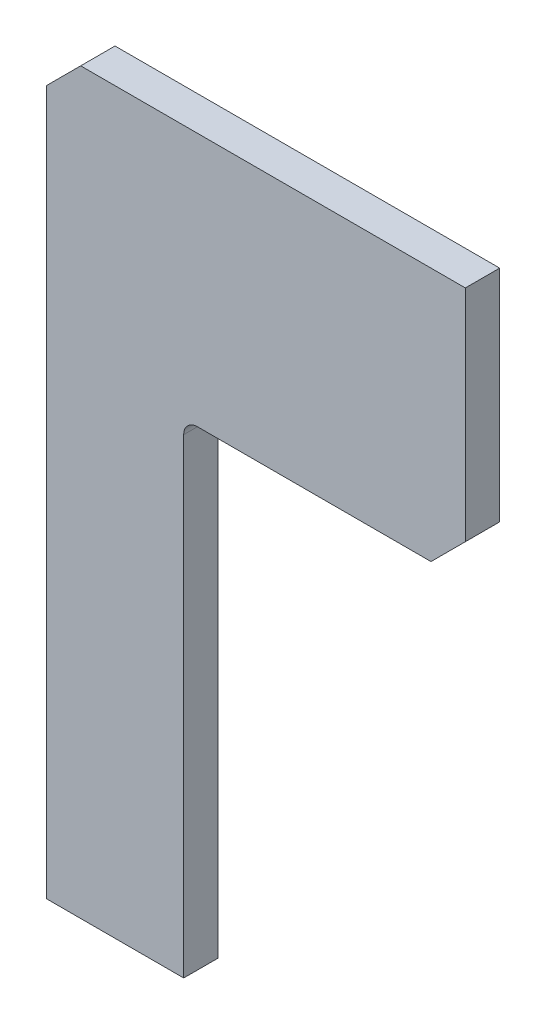
ISO-10303-21;
HEADER;
FILE_DESCRIPTION(('STEP AP214'),'2;1');
FILE_NAME('part.step','',(''),(''),'','','');
FILE_SCHEMA(('AUTOMOTIVE_DESIGN { 1 0 10303 214 1 1 1 1 }'));
ENDSEC;
DATA;
#1=APPLICATION_CONTEXT('core data for automotive mechanical design processes');
#2=APPLICATION_PROTOCOL_DEFINITION('international standard','automotive_design',2000,#1);
#3=PRODUCT_CONTEXT('',#1,'mechanical');
#4=PRODUCT('Part','Part','',(#3));
#5=PRODUCT_RELATED_PRODUCT_CATEGORY('part','',(#4));
#6=PRODUCT_DEFINITION_FORMATION('','',#4);
#7=PRODUCT_DEFINITION_CONTEXT('part definition',#1,'design');
#8=PRODUCT_DEFINITION('design','',#6,#7);
#9=PRODUCT_DEFINITION_SHAPE('','',#8);
#10=(LENGTH_UNIT() NAMED_UNIT(*) SI_UNIT(.MILLI.,.METRE.));
#11=(NAMED_UNIT(*) PLANE_ANGLE_UNIT() SI_UNIT($,.RADIAN.));
#12=(NAMED_UNIT(*) SI_UNIT($,.STERADIAN.) SOLID_ANGLE_UNIT());
#13=UNCERTAINTY_MEASURE_WITH_UNIT(LENGTH_MEASURE(1.E-05),#10,'distance_accuracy_value','');
#14=(GEOMETRIC_REPRESENTATION_CONTEXT(3) GLOBAL_UNCERTAINTY_ASSIGNED_CONTEXT((#13)) GLOBAL_UNIT_ASSIGNED_CONTEXT((#10,
#11,#12)) REPRESENTATION_CONTEXT('',''));
#15=CARTESIAN_POINT('',(0.,0.,0.));
#16=DIRECTION('',(0.,0.,1.));
#17=DIRECTION('',(1.,0.,0.));
#18=AXIS2_PLACEMENT_3D('',#15,#16,#17);
#19=CARTESIAN_POINT('',(40.,0.,10.));
#20=DIRECTION('',(0.,1.,0.));
#21=DIRECTION('',(-1.,0.,0.));
#22=AXIS2_PLACEMENT_3D('',#19,#20,#21);
#23=PLANE('',#22);
#24=DIRECTION('',(1.,0.,0.));
#25=VECTOR('',#24,1.);
#26=CARTESIAN_POINT('',(40.,0.,0.));
#27=LINE('',#26,#25);
#28=CARTESIAN_POINT('',(0.,0.,0.));
#29=VERTEX_POINT('',#28);
#30=CARTESIAN_POINT('',(40.,0.,0.));
#31=VERTEX_POINT('',#30);
#32=EDGE_CURVE('E135',#29,#31,#27,.T.);
#33=ORIENTED_EDGE('',*,*,#32,.T.);
#34=DIRECTION('',(0.,0.,-1.));
#35=VECTOR('',#34,1.);
#36=CARTESIAN_POINT('',(40.,0.,10.));
#37=LINE('',#36,#35);
#38=CARTESIAN_POINT('',(40.,0.,10.));
#39=VERTEX_POINT('',#38);
#40=EDGE_CURVE('E11',#39,#31,#37,.T.);
#41=ORIENTED_EDGE('',*,*,#40,.F.);
#42=DIRECTION('',(1.,0.,0.));
#43=VECTOR('',#42,1.);
#44=CARTESIAN_POINT('',(40.,0.,10.));
#45=LINE('',#44,#43);
#46=CARTESIAN_POINT('',(0.,0.,10.));
#47=VERTEX_POINT('',#46);
#48=EDGE_CURVE('E151',#47,#39,#45,.T.);
#49=ORIENTED_EDGE('',*,*,#48,.F.);
#50=DIRECTION('',(0.,0.,-1.));
#51=VECTOR('',#50,1.);
#52=CARTESIAN_POINT('',(0.,0.,10.));
#53=LINE('',#52,#51);
#54=EDGE_CURVE('E131',#47,#29,#53,.T.);
#55=ORIENTED_EDGE('',*,*,#54,.T.);
#56=EDGE_LOOP('',(#33,#41,#49,#55));
#57=FACE_BOUND('',#56,.T.);
#58=ADVANCED_FACE('F33',(#57),#23,.F.);
#59=CARTESIAN_POINT('',(40.,137.,10.));
#60=DIRECTION('',(-1.,0.,0.));
#61=DIRECTION('',(0.,-1.,0.));
#62=AXIS2_PLACEMENT_3D('',#59,#60,#61);
#63=PLANE('',#62);
#64=DIRECTION('',(0.,1.,0.));
#65=VECTOR('',#64,1.);
#66=CARTESIAN_POINT('',(40.,137.,0.));
#67=LINE('',#66,#65);
#68=CARTESIAN_POINT('',(40.,137.,0.));
#69=VERTEX_POINT('',#68);
#70=EDGE_CURVE('E138',#31,#69,#67,.T.);
#71=ORIENTED_EDGE('',*,*,#70,.T.);
#72=DIRECTION('',(0.,0.,-1.));
#73=VECTOR('',#72,1.);
#74=CARTESIAN_POINT('',(40.,137.,10.));
#75=LINE('',#74,#73);
#76=CARTESIAN_POINT('',(40.,137.,10.));
#77=VERTEX_POINT('',#76);
#78=EDGE_CURVE('E41',#77,#69,#75,.T.);
#79=ORIENTED_EDGE('',*,*,#78,.F.);
#80=DIRECTION('',(0.,1.,0.));
#81=VECTOR('',#80,1.);
#82=CARTESIAN_POINT('',(40.,137.,10.));
#83=LINE('',#82,#81);
#84=EDGE_CURVE('E95',#39,#77,#83,.T.);
#85=ORIENTED_EDGE('',*,*,#84,.F.);
#86=ORIENTED_EDGE('',*,*,#40,.T.);
#87=EDGE_LOOP('',(#71,#79,#85,#86));
#88=FACE_BOUND('',#87,.T.);
#89=ADVANCED_FACE('F194',(#88),#63,.F.);
#90=CARTESIAN_POINT('',(44.,137.,10.));
#91=DIRECTION('',(0.,0.,-1.));
#92=DIRECTION('',(-1.,0.,0.));
#93=AXIS2_PLACEMENT_3D('',#90,#91,#92);
#94=CYLINDRICAL_SURFACE('',#93,4.00000000000002);
#95=CARTESIAN_POINT('',(44.,137.,0.));
#96=DIRECTION('',(0.,0.,-1.));
#97=DIRECTION('',(1.,0.,0.));
#98=AXIS2_PLACEMENT_3D('',#95,#96,#97);
#99=CIRCLE('',#98,4.00000000000002);
#100=CARTESIAN_POINT('',(44.,141.,0.));
#101=VERTEX_POINT('',#100);
#102=EDGE_CURVE('E140',#69,#101,#99,.T.);
#103=ORIENTED_EDGE('',*,*,#102,.T.);
#104=DIRECTION('',(0.,0.,-1.));
#105=VECTOR('',#104,1.);
#106=CARTESIAN_POINT('',(44.,141.,10.));
#107=LINE('',#106,#105);
#108=CARTESIAN_POINT('',(44.,141.,10.));
#109=VERTEX_POINT('',#108);
#110=EDGE_CURVE('E161',#109,#101,#107,.T.);
#111=ORIENTED_EDGE('',*,*,#110,.F.);
#112=CARTESIAN_POINT('',(44.,137.,10.));
#113=DIRECTION('',(0.,0.,-1.));
#114=DIRECTION('',(1.,0.,0.));
#115=AXIS2_PLACEMENT_3D('',#112,#113,#114);
#116=CIRCLE('',#115,4.00000000000002);
#117=EDGE_CURVE('E169',#77,#109,#116,.T.);
#118=ORIENTED_EDGE('',*,*,#117,.F.);
#119=ORIENTED_EDGE('',*,*,#78,.T.);
#120=EDGE_LOOP('',(#103,#111,#118,#119));
#121=FACE_BOUND('',#120,.T.);
#122=ADVANCED_FACE('F167',(#121),#94,.F.);
#123=CARTESIAN_POINT('',(112.,141.,10.));
#124=DIRECTION('',(0.,1.,0.));
#125=DIRECTION('',(-1.,0.,0.));
#126=AXIS2_PLACEMENT_3D('',#123,#124,#125);
#127=PLANE('',#126);
#128=DIRECTION('',(1.,0.,0.));
#129=VECTOR('',#128,1.);
#130=CARTESIAN_POINT('',(112.,141.,0.));
#131=LINE('',#130,#129);
#132=CARTESIAN_POINT('',(112.,141.,0.));
#133=VERTEX_POINT('',#132);
#134=EDGE_CURVE('E142',#101,#133,#131,.T.);
#135=ORIENTED_EDGE('',*,*,#134,.T.);
#136=DIRECTION('',(0.,0.,-1.));
#137=VECTOR('',#136,1.);
#138=CARTESIAN_POINT('',(112.,141.,10.));
#139=LINE('',#138,#137);
#140=CARTESIAN_POINT('',(112.,141.,10.));
#141=VERTEX_POINT('',#140);
#142=EDGE_CURVE('E158',#141,#133,#139,.T.);
#143=ORIENTED_EDGE('',*,*,#142,.F.);
#144=DIRECTION('',(1.,0.,0.));
#145=VECTOR('',#144,1.);
#146=CARTESIAN_POINT('',(112.,141.,10.));
#147=LINE('',#146,#145);
#148=EDGE_CURVE('E185',#109,#141,#147,.T.);
#149=ORIENTED_EDGE('',*,*,#148,.F.);
#150=ORIENTED_EDGE('',*,*,#110,.T.);
#151=EDGE_LOOP('',(#135,#143,#149,#150));
#152=FACE_BOUND('',#151,.T.);
#153=ADVANCED_FACE('F178',(#152),#127,.F.);
#154=CARTESIAN_POINT('',(122.,151.,10.));
#155=DIRECTION('',(-0.707106781186548,0.707106781186547,0.));
#156=DIRECTION('',(-0.707106781186547,-0.707106781186548,0.));
#157=AXIS2_PLACEMENT_3D('',#154,#155,#156);
#158=PLANE('',#157);
#159=DIRECTION('',(0.707106781186547,0.707106781186548,0.));
#160=VECTOR('',#159,1.);
#161=CARTESIAN_POINT('',(122.,151.,0.));
#162=LINE('',#161,#160);
#163=CARTESIAN_POINT('',(122.,151.,0.));
#164=VERTEX_POINT('',#163);
#165=EDGE_CURVE('E144',#133,#164,#162,.T.);
#166=ORIENTED_EDGE('',*,*,#165,.T.);
#167=DIRECTION('',(0.,0.,-1.));
#168=VECTOR('',#167,1.);
#169=CARTESIAN_POINT('',(122.,151.,10.));
#170=LINE('',#169,#168);
#171=CARTESIAN_POINT('',(122.,151.,10.));
#172=VERTEX_POINT('',#171);
#173=EDGE_CURVE('E155',#172,#164,#170,.T.);
#174=ORIENTED_EDGE('',*,*,#173,.F.);
#175=DIRECTION('',(0.707106781186547,0.707106781186548,0.));
#176=VECTOR('',#175,1.);
#177=CARTESIAN_POINT('',(122.,151.,10.));
#178=LINE('',#177,#176);
#179=EDGE_CURVE('E184',#141,#172,#178,.T.);
#180=ORIENTED_EDGE('',*,*,#179,.F.);
#181=ORIENTED_EDGE('',*,*,#142,.T.);
#182=EDGE_LOOP('',(#166,#174,#180,#181));
#183=FACE_BOUND('',#182,.T.);
#184=ADVANCED_FACE('F182',(#183),#158,.F.);
#185=CARTESIAN_POINT('',(122.,215.,10.));
#186=DIRECTION('',(-1.,0.,0.));
#187=DIRECTION('',(0.,-1.,0.));
#188=AXIS2_PLACEMENT_3D('',#185,#186,#187);
#189=PLANE('',#188);
#190=DIRECTION('',(0.,1.,0.));
#191=VECTOR('',#190,1.);
#192=CARTESIAN_POINT('',(122.,215.,0.));
#193=LINE('',#192,#191);
#194=CARTESIAN_POINT('',(122.,215.,0.));
#195=VERTEX_POINT('',#194);
#196=EDGE_CURVE('E146',#164,#195,#193,.T.);
#197=ORIENTED_EDGE('',*,*,#196,.T.);
#198=DIRECTION('',(0.,0.,-1.));
#199=VECTOR('',#198,1.);
#200=CARTESIAN_POINT('',(122.,215.,10.));
#201=LINE('',#200,#199);
#202=CARTESIAN_POINT('',(122.,215.,10.));
#203=VERTEX_POINT('',#202);
#204=EDGE_CURVE('E126',#203,#195,#201,.T.);
#205=ORIENTED_EDGE('',*,*,#204,.F.);
#206=DIRECTION('',(0.,1.,0.));
#207=VECTOR('',#206,1.);
#208=CARTESIAN_POINT('',(122.,215.,10.));
#209=LINE('',#208,#207);
#210=EDGE_CURVE('E117',#172,#203,#209,.T.);
#211=ORIENTED_EDGE('',*,*,#210,.F.);
#212=ORIENTED_EDGE('',*,*,#173,.T.);
#213=EDGE_LOOP('',(#197,#205,#211,#212));
#214=FACE_BOUND('',#213,.T.);
#215=ADVANCED_FACE('F206',(#214),#189,.F.);
#216=CARTESIAN_POINT('',(10.,215.,10.));
#217=DIRECTION('',(0.,-1.,0.));
#218=DIRECTION('',(0.,0.,-1.));
#219=AXIS2_PLACEMENT_3D('',#216,#217,#218);
#220=PLANE('',#219);
#221=DIRECTION('',(-1.,0.,0.));
#222=VECTOR('',#221,1.);
#223=CARTESIAN_POINT('',(10.,215.,0.));
#224=LINE('',#223,#222);
#225=CARTESIAN_POINT('',(10.,215.,0.));
#226=VERTEX_POINT('',#225);
#227=EDGE_CURVE('E125',#195,#226,#224,.T.);
#228=ORIENTED_EDGE('',*,*,#227,.T.);
#229=DIRECTION('',(0.,0.,-1.));
#230=VECTOR('',#229,1.);
#231=CARTESIAN_POINT('',(10.,215.,10.));
#232=LINE('',#231,#230);
#233=CARTESIAN_POINT('',(10.,215.,10.));
#234=VERTEX_POINT('',#233);
#235=EDGE_CURVE('E122',#234,#226,#232,.T.);
#236=ORIENTED_EDGE('',*,*,#235,.F.);
#237=DIRECTION('',(-1.,0.,0.));
#238=VECTOR('',#237,1.);
#239=CARTESIAN_POINT('',(10.,215.,10.));
#240=LINE('',#239,#238);
#241=EDGE_CURVE('E111',#203,#234,#240,.T.);
#242=ORIENTED_EDGE('',*,*,#241,.F.);
#243=ORIENTED_EDGE('',*,*,#204,.T.);
#244=EDGE_LOOP('',(#228,#236,#242,#243));
#245=FACE_BOUND('',#244,.T.);
#246=ADVANCED_FACE('F123',(#245),#220,.F.);
#247=CARTESIAN_POINT('',(0.,205.,10.));
#248=DIRECTION('',(0.707106781186548,-0.707106781186547,0.));
#249=DIRECTION('',(0.707106781186547,0.707106781186548,0.));
#250=AXIS2_PLACEMENT_3D('',#247,#248,#249);
#251=PLANE('',#250);
#252=DIRECTION('',(-0.707106781186547,-0.707106781186548,0.));
#253=VECTOR('',#252,1.);
#254=CARTESIAN_POINT('',(0.,205.,0.));
#255=LINE('',#254,#253);
#256=CARTESIAN_POINT('',(0.,205.,0.));
#257=VERTEX_POINT('',#256);
#258=EDGE_CURVE('E81',#226,#257,#255,.T.);
#259=ORIENTED_EDGE('',*,*,#258,.T.);
#260=DIRECTION('',(0.,0.,-1.));
#261=VECTOR('',#260,1.);
#262=CARTESIAN_POINT('',(0.,205.,10.));
#263=LINE('',#262,#261);
#264=CARTESIAN_POINT('',(0.,205.,10.));
#265=VERTEX_POINT('',#264);
#266=EDGE_CURVE('E127',#265,#257,#263,.T.);
#267=ORIENTED_EDGE('',*,*,#266,.F.);
#268=DIRECTION('',(-0.707106781186547,-0.707106781186548,0.));
#269=VECTOR('',#268,1.);
#270=CARTESIAN_POINT('',(0.,205.,10.));
#271=LINE('',#270,#269);
#272=EDGE_CURVE('E115',#234,#265,#271,.T.);
#273=ORIENTED_EDGE('',*,*,#272,.F.);
#274=ORIENTED_EDGE('',*,*,#235,.T.);
#275=EDGE_LOOP('',(#259,#267,#273,#274));
#276=FACE_BOUND('',#275,.T.);
#277=ADVANCED_FACE('F129',(#276),#251,.F.);
#278=CARTESIAN_POINT('',(0.,0.,10.));
#279=DIRECTION('',(1.,0.,0.));
#280=DIRECTION('',(0.,0.,-1.));
#281=AXIS2_PLACEMENT_3D('',#278,#279,#280);
#282=PLANE('',#281);
#283=DIRECTION('',(0.,-1.,0.));
#284=VECTOR('',#283,1.);
#285=CARTESIAN_POINT('',(0.,0.,0.));
#286=LINE('',#285,#284);
#287=EDGE_CURVE('E87',#257,#29,#286,.T.);
#288=ORIENTED_EDGE('',*,*,#287,.T.);
#289=ORIENTED_EDGE('',*,*,#54,.F.);
#290=DIRECTION('',(0.,-1.,0.));
#291=VECTOR('',#290,1.);
#292=CARTESIAN_POINT('',(0.,0.,10.));
#293=LINE('',#292,#291);
#294=EDGE_CURVE('E49',#265,#47,#293,.T.);
#295=ORIENTED_EDGE('',*,*,#294,.F.);
#296=ORIENTED_EDGE('',*,*,#266,.T.);
#297=EDGE_LOOP('',(#288,#289,#295,#296));
#298=FACE_BOUND('',#297,.T.);
#299=ADVANCED_FACE('F214',(#298),#282,.F.);
#300=CARTESIAN_POINT('',(44.,137.,10.));
#301=DIRECTION('',(0.,0.,1.));
#302=DIRECTION('',(1.,0.,0.));
#303=AXIS2_PLACEMENT_3D('',#300,#301,#302);
#304=PLANE('',#303);
#305=ORIENTED_EDGE('',*,*,#48,.T.);
#306=ORIENTED_EDGE('',*,*,#84,.T.);
#307=ORIENTED_EDGE('',*,*,#117,.T.);
#308=ORIENTED_EDGE('',*,*,#148,.T.);
#309=ORIENTED_EDGE('',*,*,#179,.T.);
#310=ORIENTED_EDGE('',*,*,#210,.T.);
#311=ORIENTED_EDGE('',*,*,#241,.T.);
#312=ORIENTED_EDGE('',*,*,#272,.T.);
#313=ORIENTED_EDGE('',*,*,#294,.T.);
#314=EDGE_LOOP('',(#305,#306,#307,#308,#309,#310,#311,#312,#313));
#315=FACE_BOUND('',#314,.T.);
#316=ADVANCED_FACE('F113',(#315),#304,.T.);
#317=CARTESIAN_POINT('',(44.,137.,0.));
#318=DIRECTION('',(0.,0.,1.));
#319=DIRECTION('',(1.,0.,0.));
#320=AXIS2_PLACEMENT_3D('',#317,#318,#319);
#321=PLANE('',#320);
#322=ORIENTED_EDGE('',*,*,#32,.F.);
#323=ORIENTED_EDGE('',*,*,#287,.F.);
#324=ORIENTED_EDGE('',*,*,#258,.F.);
#325=ORIENTED_EDGE('',*,*,#227,.F.);
#326=ORIENTED_EDGE('',*,*,#196,.F.);
#327=ORIENTED_EDGE('',*,*,#165,.F.);
#328=ORIENTED_EDGE('',*,*,#134,.F.);
#329=ORIENTED_EDGE('',*,*,#102,.F.);
#330=ORIENTED_EDGE('',*,*,#70,.F.);
#331=EDGE_LOOP('',(#322,#323,#324,#325,#326,#327,#328,#329,#330));
#332=FACE_BOUND('',#331,.T.);
#333=ADVANCED_FACE('F173',(#332),#321,.F.);
#334=CLOSED_SHELL('',(#58,#89,#122,#153,#184,#215,#246,#277,#299,#316,#333));
#335=MANIFOLD_SOLID_BREP('B2',#334);
#336=ADVANCED_BREP_SHAPE_REPRESENTATION('',(#18,#335),#14);
#337=SHAPE_DEFINITION_REPRESENTATION(#9,#336);
ENDSEC;
END-ISO-10303-21;
